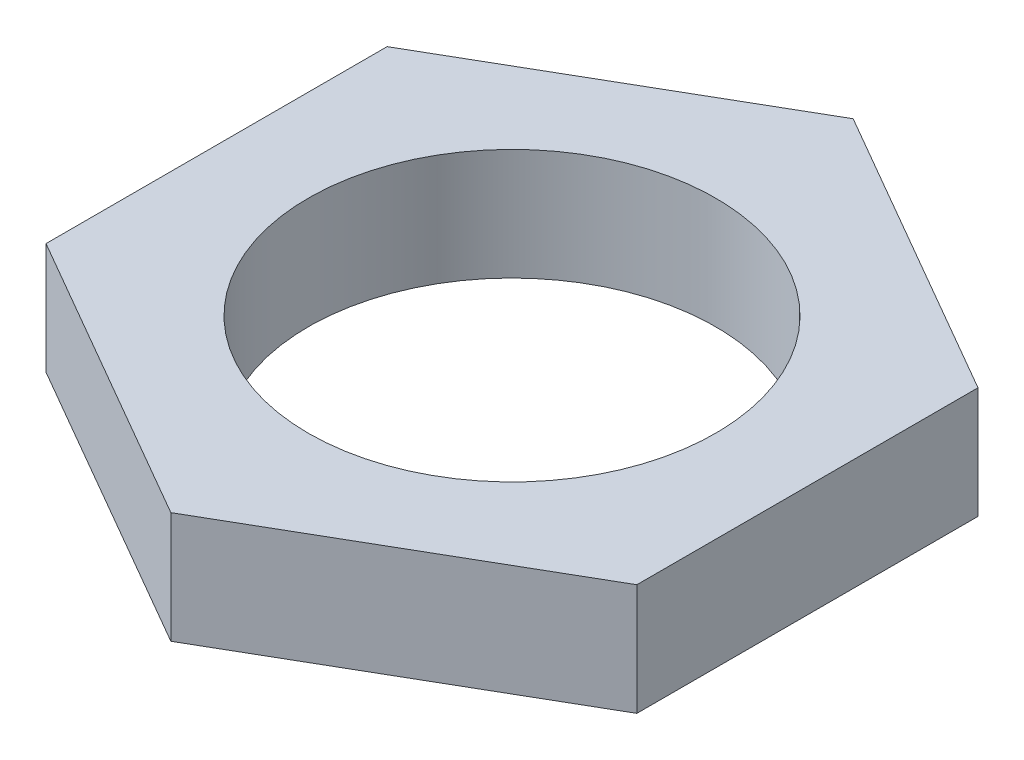
ISO-10303-21;
HEADER;
FILE_DESCRIPTION(('STEP AP214'),'2;1');
FILE_NAME('part.step','',(''),(''),'','','');
FILE_SCHEMA(('AUTOMOTIVE_DESIGN { 1 0 10303 214 1 1 1 1 }'));
ENDSEC;
DATA;
#1=APPLICATION_CONTEXT('core data for automotive mechanical design processes');
#2=APPLICATION_PROTOCOL_DEFINITION('international standard','automotive_design',2000,#1);
#3=PRODUCT_CONTEXT('',#1,'mechanical');
#4=PRODUCT('Part','Part','',(#3));
#5=PRODUCT_RELATED_PRODUCT_CATEGORY('part','',(#4));
#6=PRODUCT_DEFINITION_FORMATION('','',#4);
#7=PRODUCT_DEFINITION_CONTEXT('part definition',#1,'design');
#8=PRODUCT_DEFINITION('design','',#6,#7);
#9=PRODUCT_DEFINITION_SHAPE('','',#8);
#10=(LENGTH_UNIT() NAMED_UNIT(*) SI_UNIT(.MILLI.,.METRE.));
#11=(NAMED_UNIT(*) PLANE_ANGLE_UNIT() SI_UNIT($,.RADIAN.));
#12=(NAMED_UNIT(*) SI_UNIT($,.STERADIAN.) SOLID_ANGLE_UNIT());
#13=UNCERTAINTY_MEASURE_WITH_UNIT(LENGTH_MEASURE(1.E-05),#10,'distance_accuracy_value','');
#14=(GEOMETRIC_REPRESENTATION_CONTEXT(3) GLOBAL_UNCERTAINTY_ASSIGNED_CONTEXT((#13)) GLOBAL_UNIT_ASSIGNED_CONTEXT((#10,
#11,#12)) REPRESENTATION_CONTEXT('',''));
#15=CARTESIAN_POINT('',(0.,0.,0.));
#16=DIRECTION('',(0.,0.,1.));
#17=DIRECTION('',(1.,0.,0.));
#18=AXIS2_PLACEMENT_3D('',#15,#16,#17);
#19=CARTESIAN_POINT('',(0.,1.32,-4.04145188432738));
#20=DIRECTION('',(0.5,0.,0.866025403784439));
#21=DIRECTION('',(0.866025403784439,0.,-0.5));
#22=AXIS2_PLACEMENT_3D('',#19,#20,#21);
#23=PLANE('',#22);
#24=DIRECTION('',(-0.866025403784439,0.,0.5));
#25=VECTOR('',#24,1.);
#26=CARTESIAN_POINT('',(0.,0.,-4.04145188432738));
#27=LINE('',#26,#25);
#28=CARTESIAN_POINT('',(0.,0.,-4.04145188432738));
#29=VERTEX_POINT('',#28);
#30=CARTESIAN_POINT('',(-3.5,0.,-2.02072594216369));
#31=VERTEX_POINT('',#30);
#32=EDGE_CURVE('E116',#29,#31,#27,.T.);
#33=ORIENTED_EDGE('',*,*,#32,.T.);
#34=DIRECTION('',(0.,-1.,0.));
#35=VECTOR('',#34,1.);
#36=CARTESIAN_POINT('',(-3.5,1.32,-2.02072594216369));
#37=LINE('',#36,#35);
#38=CARTESIAN_POINT('',(-3.5,1.32,-2.02072594216369));
#39=VERTEX_POINT('',#38);
#40=EDGE_CURVE('E11',#39,#31,#37,.T.);
#41=ORIENTED_EDGE('',*,*,#40,.F.);
#42=DIRECTION('',(-0.866025403784439,0.,0.5));
#43=VECTOR('',#42,1.);
#44=CARTESIAN_POINT('',(0.,1.32,-4.04145188432738));
#45=LINE('',#44,#43);
#46=CARTESIAN_POINT('',(0.,1.32,-4.04145188432738));
#47=VERTEX_POINT('',#46);
#48=EDGE_CURVE('E127',#47,#39,#45,.T.);
#49=ORIENTED_EDGE('',*,*,#48,.F.);
#50=DIRECTION('',(0.,-1.,0.));
#51=VECTOR('',#50,1.);
#52=CARTESIAN_POINT('',(0.,1.32,-4.04145188432738));
#53=LINE('',#52,#51);
#54=EDGE_CURVE('E112',#47,#29,#53,.T.);
#55=ORIENTED_EDGE('',*,*,#54,.T.);
#56=EDGE_LOOP('',(#33,#41,#49,#55));
#57=FACE_BOUND('',#56,.T.);
#58=ADVANCED_FACE('F32',(#57),#23,.F.);
#59=CARTESIAN_POINT('',(-3.5,1.32,-2.02072594216369));
#60=DIRECTION('',(1.,0.,0.));
#61=DIRECTION('',(0.,0.,-1.));
#62=AXIS2_PLACEMENT_3D('',#59,#60,#61);
#63=PLANE('',#62);
#64=DIRECTION('',(0.,0.,1.));
#65=VECTOR('',#64,1.);
#66=CARTESIAN_POINT('',(-3.5,0.,-2.02072594216369));
#67=LINE('',#66,#65);
#68=CARTESIAN_POINT('',(-3.5,0.,2.02072594216369));
#69=VERTEX_POINT('',#68);
#70=EDGE_CURVE('E119',#31,#69,#67,.T.);
#71=ORIENTED_EDGE('',*,*,#70,.T.);
#72=DIRECTION('',(0.,-1.,0.));
#73=VECTOR('',#72,1.);
#74=CARTESIAN_POINT('',(-3.5,1.32,2.02072594216369));
#75=LINE('',#74,#73);
#76=CARTESIAN_POINT('',(-3.5,1.32,2.02072594216369));
#77=VERTEX_POINT('',#76);
#78=EDGE_CURVE('E40',#77,#69,#75,.T.);
#79=ORIENTED_EDGE('',*,*,#78,.F.);
#80=DIRECTION('',(0.,0.,1.));
#81=VECTOR('',#80,1.);
#82=CARTESIAN_POINT('',(-3.5,1.32,-2.02072594216369));
#83=LINE('',#82,#81);
#84=EDGE_CURVE('E85',#39,#77,#83,.T.);
#85=ORIENTED_EDGE('',*,*,#84,.F.);
#86=ORIENTED_EDGE('',*,*,#40,.T.);
#87=EDGE_LOOP('',(#71,#79,#85,#86));
#88=FACE_BOUND('',#87,.T.);
#89=ADVANCED_FACE('F152',(#88),#63,.F.);
#90=CARTESIAN_POINT('',(-3.5,1.32,2.02072594216369));
#91=DIRECTION('',(0.5,0.,-0.866025403784439));
#92=DIRECTION('',(-0.866025403784439,0.,-0.5));
#93=AXIS2_PLACEMENT_3D('',#90,#91,#92);
#94=PLANE('',#93);
#95=DIRECTION('',(0.866025403784439,0.,0.5));
#96=VECTOR('',#95,1.);
#97=CARTESIAN_POINT('',(-3.5,0.,2.02072594216369));
#98=LINE('',#97,#96);
#99=CARTESIAN_POINT('',(0.,0.,4.04145188432738));
#100=VERTEX_POINT('',#99);
#101=EDGE_CURVE('E122',#69,#100,#98,.T.);
#102=ORIENTED_EDGE('',*,*,#101,.T.);
#103=DIRECTION('',(0.,-1.,0.));
#104=VECTOR('',#103,1.);
#105=CARTESIAN_POINT('',(0.,1.32,4.04145188432738));
#106=LINE('',#105,#104);
#107=CARTESIAN_POINT('',(0.,1.32,4.04145188432738));
#108=VERTEX_POINT('',#107);
#109=EDGE_CURVE('E107',#108,#100,#106,.T.);
#110=ORIENTED_EDGE('',*,*,#109,.F.);
#111=DIRECTION('',(0.866025403784439,0.,0.5));
#112=VECTOR('',#111,1.);
#113=CARTESIAN_POINT('',(-3.5,1.32,2.02072594216369));
#114=LINE('',#113,#112);
#115=EDGE_CURVE('E98',#77,#108,#114,.T.);
#116=ORIENTED_EDGE('',*,*,#115,.F.);
#117=ORIENTED_EDGE('',*,*,#78,.T.);
#118=EDGE_LOOP('',(#102,#110,#116,#117));
#119=FACE_BOUND('',#118,.T.);
#120=ADVANCED_FACE('F133',(#119),#94,.F.);
#121=CARTESIAN_POINT('',(0.,1.32,4.04145188432738));
#122=DIRECTION('',(-0.5,0.,-0.866025403784439));
#123=DIRECTION('',(-0.866025403784438,0.,0.5));
#124=AXIS2_PLACEMENT_3D('',#121,#122,#123);
#125=PLANE('',#124);
#126=DIRECTION('',(0.866025403784438,0.,-0.5));
#127=VECTOR('',#126,1.);
#128=CARTESIAN_POINT('',(0.,0.,4.04145188432738));
#129=LINE('',#128,#127);
#130=CARTESIAN_POINT('',(3.5,0.,2.02072594216369));
#131=VERTEX_POINT('',#130);
#132=EDGE_CURVE('E106',#100,#131,#129,.T.);
#133=ORIENTED_EDGE('',*,*,#132,.T.);
#134=DIRECTION('',(0.,-1.,0.));
#135=VECTOR('',#134,1.);
#136=CARTESIAN_POINT('',(3.5,1.32,2.02072594216369));
#137=LINE('',#136,#135);
#138=CARTESIAN_POINT('',(3.5,1.32,2.02072594216369));
#139=VERTEX_POINT('',#138);
#140=EDGE_CURVE('E103',#139,#131,#137,.T.);
#141=ORIENTED_EDGE('',*,*,#140,.F.);
#142=DIRECTION('',(0.866025403784438,0.,-0.5));
#143=VECTOR('',#142,1.);
#144=CARTESIAN_POINT('',(0.,1.32,4.04145188432738));
#145=LINE('',#144,#143);
#146=EDGE_CURVE('E92',#108,#139,#145,.T.);
#147=ORIENTED_EDGE('',*,*,#146,.F.);
#148=ORIENTED_EDGE('',*,*,#109,.T.);
#149=EDGE_LOOP('',(#133,#141,#147,#148));
#150=FACE_BOUND('',#149,.T.);
#151=ADVANCED_FACE('F104',(#150),#125,.F.);
#152=CARTESIAN_POINT('',(3.5,1.32,2.02072594216369));
#153=DIRECTION('',(-1.,0.,0.));
#154=DIRECTION('',(0.,0.,1.));
#155=AXIS2_PLACEMENT_3D('',#152,#153,#154);
#156=PLANE('',#155);
#157=DIRECTION('',(0.,0.,-1.));
#158=VECTOR('',#157,1.);
#159=CARTESIAN_POINT('',(3.5,0.,2.02072594216369));
#160=LINE('',#159,#158);
#161=CARTESIAN_POINT('',(3.5,0.,-2.02072594216369));
#162=VERTEX_POINT('',#161);
#163=EDGE_CURVE('E71',#131,#162,#160,.T.);
#164=ORIENTED_EDGE('',*,*,#163,.T.);
#165=DIRECTION('',(0.,-1.,0.));
#166=VECTOR('',#165,1.);
#167=CARTESIAN_POINT('',(3.5,1.32,-2.02072594216369));
#168=LINE('',#167,#166);
#169=CARTESIAN_POINT('',(3.5,1.32,-2.02072594216369));
#170=VERTEX_POINT('',#169);
#171=EDGE_CURVE('E108',#170,#162,#168,.T.);
#172=ORIENTED_EDGE('',*,*,#171,.F.);
#173=DIRECTION('',(0.,0.,-1.));
#174=VECTOR('',#173,1.);
#175=CARTESIAN_POINT('',(3.5,1.32,2.02072594216369));
#176=LINE('',#175,#174);
#177=EDGE_CURVE('E96',#139,#170,#176,.T.);
#178=ORIENTED_EDGE('',*,*,#177,.F.);
#179=ORIENTED_EDGE('',*,*,#140,.T.);
#180=EDGE_LOOP('',(#164,#172,#178,#179));
#181=FACE_BOUND('',#180,.T.);
#182=ADVANCED_FACE('F110',(#181),#156,.F.);
#183=CARTESIAN_POINT('',(3.5,1.32,-2.02072594216369));
#184=DIRECTION('',(-0.5,0.,0.866025403784439));
#185=DIRECTION('',(0.866025403784439,0.,0.5));
#186=AXIS2_PLACEMENT_3D('',#183,#184,#185);
#187=PLANE('',#186);
#188=DIRECTION('',(-0.866025403784439,0.,-0.5));
#189=VECTOR('',#188,1.);
#190=CARTESIAN_POINT('',(3.5,0.,-2.02072594216369));
#191=LINE('',#190,#189);
#192=EDGE_CURVE('E77',#162,#29,#191,.T.);
#193=ORIENTED_EDGE('',*,*,#192,.T.);
#194=ORIENTED_EDGE('',*,*,#54,.F.);
#195=DIRECTION('',(-0.866025403784439,0.,-0.5));
#196=VECTOR('',#195,1.);
#197=CARTESIAN_POINT('',(3.5,1.32,-2.02072594216369));
#198=LINE('',#197,#196);
#199=EDGE_CURVE('E48',#170,#47,#198,.T.);
#200=ORIENTED_EDGE('',*,*,#199,.F.);
#201=ORIENTED_EDGE('',*,*,#171,.T.);
#202=EDGE_LOOP('',(#193,#194,#200,#201));
#203=FACE_BOUND('',#202,.T.);
#204=ADVANCED_FACE('F140',(#203),#187,.F.);
#205=CARTESIAN_POINT('',(0.,1.32,0.));
#206=DIRECTION('',(0.,1.,0.));
#207=DIRECTION('',(0.,0.,1.));
#208=AXIS2_PLACEMENT_3D('',#205,#206,#207);
#209=PLANE('',#208);
#210=CARTESIAN_POINT('',(0.,1.32,0.));
#211=DIRECTION('',(0.,1.,0.));
#212=DIRECTION('',(0.,0.,1.));
#213=AXIS2_PLACEMENT_3D('',#210,#211,#212);
#214=CIRCLE('',#213,2.413);
#215=CARTESIAN_POINT('',(0.,1.32,2.413));
#216=VERTEX_POINT('',#215);
#217=EDGE_CURVE('E207',#216,#216,#214,.T.);
#218=ORIENTED_EDGE('',*,*,#217,.F.);
#219=EDGE_LOOP('',(#218));
#220=FACE_BOUND('',#219,.T.);
#221=ORIENTED_EDGE('',*,*,#48,.T.);
#222=ORIENTED_EDGE('',*,*,#84,.T.);
#223=ORIENTED_EDGE('',*,*,#115,.T.);
#224=ORIENTED_EDGE('',*,*,#146,.T.);
#225=ORIENTED_EDGE('',*,*,#177,.T.);
#226=ORIENTED_EDGE('',*,*,#199,.T.);
#227=EDGE_LOOP('',(#221,#222,#223,#224,#225,#226));
#228=FACE_BOUND('',#227,.T.);
#229=ADVANCED_FACE('F94',(#220,#228),#209,.T.);
#230=CARTESIAN_POINT('',(0.,0.,0.));
#231=DIRECTION('',(0.,1.,0.));
#232=DIRECTION('',(0.,0.,1.));
#233=AXIS2_PLACEMENT_3D('',#230,#231,#232);
#234=PLANE('',#233);
#235=CARTESIAN_POINT('',(0.,0.,0.));
#236=DIRECTION('',(0.,1.,0.));
#237=DIRECTION('',(0.,0.,1.));
#238=AXIS2_PLACEMENT_3D('',#235,#236,#237);
#239=CIRCLE('',#238,2.413);
#240=CARTESIAN_POINT('',(0.,0.,2.413));
#241=VERTEX_POINT('',#240);
#242=EDGE_CURVE('E120',#241,#241,#239,.T.);
#243=ORIENTED_EDGE('',*,*,#242,.T.);
#244=EDGE_LOOP('',(#243));
#245=FACE_BOUND('',#244,.T.);
#246=ORIENTED_EDGE('',*,*,#32,.F.);
#247=ORIENTED_EDGE('',*,*,#192,.F.);
#248=ORIENTED_EDGE('',*,*,#163,.F.);
#249=ORIENTED_EDGE('',*,*,#132,.F.);
#250=ORIENTED_EDGE('',*,*,#101,.F.);
#251=ORIENTED_EDGE('',*,*,#70,.F.);
#252=EDGE_LOOP('',(#246,#247,#248,#249,#250,#251));
#253=FACE_BOUND('',#252,.T.);
#254=ADVANCED_FACE('F136',(#245,#253),#234,.F.);
#255=CARTESIAN_POINT('',(0.,0.,0.));
#256=DIRECTION('',(0.,1.,0.));
#257=DIRECTION('',(0.,0.,1.));
#258=AXIS2_PLACEMENT_3D('',#255,#256,#257);
#259=CYLINDRICAL_SURFACE('',#258,2.413);
#260=ORIENTED_EDGE('',*,*,#242,.F.);
#261=EDGE_LOOP('',(#260));
#262=FACE_BOUND('',#261,.T.);
#263=ORIENTED_EDGE('',*,*,#217,.T.);
#264=EDGE_LOOP('',(#263));
#265=FACE_BOUND('',#264,.T.);
#266=ADVANCED_FACE('F189',(#262,#265),#259,.F.);
#267=CLOSED_SHELL('',(#58,#89,#120,#151,#182,#204,#229,#254,#266));
#268=MANIFOLD_SOLID_BREP('B2',#267);
#269=ADVANCED_BREP_SHAPE_REPRESENTATION('',(#18,#268),#14);
#270=SHAPE_DEFINITION_REPRESENTATION(#9,#269);
ENDSEC;
END-ISO-10303-21;
